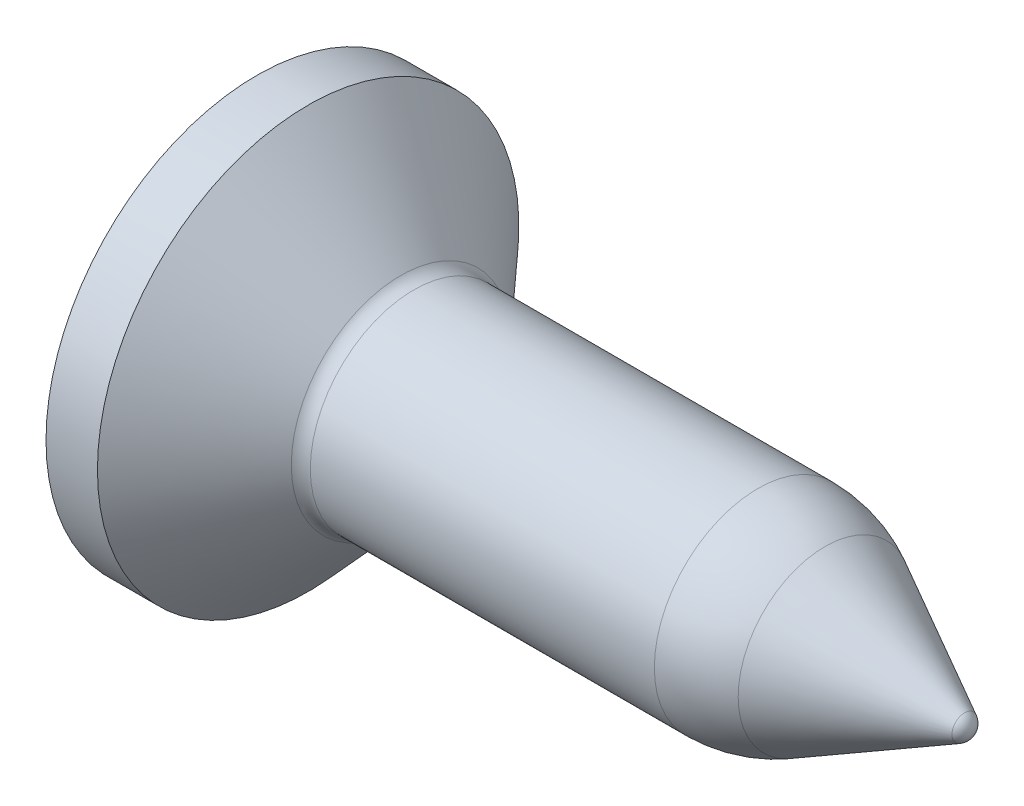
ISO-10303-21;
HEADER;
FILE_DESCRIPTION(('STEP AP214'),'2;1');
FILE_NAME('part.step','',(''),(''),'','','');
FILE_SCHEMA(('AUTOMOTIVE_DESIGN { 1 0 10303 214 1 1 1 1 }'));
ENDSEC;
DATA;
#1=APPLICATION_CONTEXT('core data for automotive mechanical design processes');
#2=APPLICATION_PROTOCOL_DEFINITION('international standard','automotive_design',2000,#1);
#3=PRODUCT_CONTEXT('',#1,'mechanical');
#4=PRODUCT('Part','Part','',(#3));
#5=PRODUCT_RELATED_PRODUCT_CATEGORY('part','',(#4));
#6=PRODUCT_DEFINITION_FORMATION('','',#4);
#7=PRODUCT_DEFINITION_CONTEXT('part definition',#1,'design');
#8=PRODUCT_DEFINITION('design','',#6,#7);
#9=PRODUCT_DEFINITION_SHAPE('','',#8);
#10=(LENGTH_UNIT() NAMED_UNIT(*) SI_UNIT(.MILLI.,.METRE.));
#11=(NAMED_UNIT(*) PLANE_ANGLE_UNIT() SI_UNIT($,.RADIAN.));
#12=(NAMED_UNIT(*) SI_UNIT($,.STERADIAN.) SOLID_ANGLE_UNIT());
#13=UNCERTAINTY_MEASURE_WITH_UNIT(LENGTH_MEASURE(1.E-05),#10,'distance_accuracy_value','');
#14=(GEOMETRIC_REPRESENTATION_CONTEXT(3) GLOBAL_UNCERTAINTY_ASSIGNED_CONTEXT((#13)) GLOBAL_UNIT_ASSIGNED_CONTEXT((#10,
#11,#12)) REPRESENTATION_CONTEXT('',''));
#15=CARTESIAN_POINT('',(0.,0.,0.));
#16=DIRECTION('',(0.,0.,1.));
#17=DIRECTION('',(1.,0.,0.));
#18=AXIS2_PLACEMENT_3D('',#15,#16,#17);
#19=CARTESIAN_POINT('',(9.81538931690745,0.,0.));
#20=DIRECTION('',(-1.,0.,0.));
#21=DIRECTION('',(0.,1.,0.));
#22=AXIS2_PLACEMENT_3D('',#19,#20,#21);
#23=SPHERICAL_SURFACE('',#22,0.200000000000001);
#24=CARTESIAN_POINT('',(9.90931550129047,0.,0.));
#25=DIRECTION('',(-1.,0.,0.));
#26=DIRECTION('',(0.,0.,1.));
#27=AXIS2_PLACEMENT_3D('',#24,#25,#26);
#28=CIRCLE('',#27,0.176572568331685);
#29=CARTESIAN_POINT('',(9.90931550129047,0.,0.176572568331685));
#30=VERTEX_POINT('',#29);
#31=EDGE_CURVE('E11',#30,#30,#28,.T.);
#32=ORIENTED_EDGE('',*,*,#31,.F.);
#33=EDGE_LOOP('',(#32));
#34=FACE_BOUND('',#33,.T.);
#35=ADVANCED_FACE('F33',(#34),#23,.T.);
#36=CARTESIAN_POINT('',(9.90931550129047,0.,0.));
#37=DIRECTION('',(-1.,0.,0.));
#38=DIRECTION('',(0.,0.,1.));
#39=AXIS2_PLACEMENT_3D('',#36,#37,#38);
#40=CONICAL_SURFACE('',#39,0.176572568331685,0.488872684597469);
#41=CARTESIAN_POINT('',(7.9558034363846,0.,0.));
#42=DIRECTION('',(-1.,0.,0.));
#43=DIRECTION('',(0.,0.,1.));
#44=AXIS2_PLACEMENT_3D('',#41,#42,#43);
#45=CIRCLE('',#44,1.21572568331684);
#46=CARTESIAN_POINT('',(7.9558034363846,0.,1.21572568331684));
#47=VERTEX_POINT('',#46);
#48=EDGE_CURVE('E40',#47,#47,#45,.T.);
#49=ORIENTED_EDGE('',*,*,#48,.F.);
#50=EDGE_LOOP('',(#49));
#51=FACE_BOUND('',#50,.T.);
#52=ORIENTED_EDGE('',*,*,#31,.T.);
#53=EDGE_LOOP('',(#52));
#54=FACE_BOUND('',#53,.T.);
#55=ADVANCED_FACE('F224',(#51,#54),#40,.T.);
#56=CARTESIAN_POINT('',(7.01654159255442,0.,0.));
#57=DIRECTION('',(-1.,0.,0.));
#58=DIRECTION('',(0.,0.,1.));
#59=AXIS2_PLACEMENT_3D('',#56,#57,#58);
#60=DEGENERATE_TOROIDAL_SURFACE('',#59,0.55,2.,.F.);
#61=CARTESIAN_POINT('',(7.01654159255442,0.,0.));
#62=DIRECTION('',(-1.,0.,0.));
#63=DIRECTION('',(0.,0.,1.));
#64=AXIS2_PLACEMENT_3D('',#61,#62,#63);
#65=CIRCLE('',#64,1.45);
#66=CARTESIAN_POINT('',(7.01654159255442,0.,1.45));
#67=VERTEX_POINT('',#66);
#68=EDGE_CURVE('E217',#67,#67,#65,.T.);
#69=ORIENTED_EDGE('',*,*,#68,.F.);
#70=EDGE_LOOP('',(#69));
#71=FACE_BOUND('',#70,.T.);
#72=ORIENTED_EDGE('',*,*,#48,.T.);
#73=EDGE_LOOP('',(#72));
#74=FACE_BOUND('',#73,.T.);
#75=ADVANCED_FACE('F222',(#71,#74),#60,.F.);
#76=CARTESIAN_POINT('',(-3.97468528266504,0.,0.));
#77=DIRECTION('',(-1.,0.,0.));
#78=DIRECTION('',(0.,0.,1.));
#79=AXIS2_PLACEMENT_3D('',#76,#77,#78);
#80=CYLINDRICAL_SURFACE('',#79,1.45);
#81=CARTESIAN_POINT('',(2.2,0.,0.));
#82=DIRECTION('',(-1.,0.,0.));
#83=DIRECTION('',(0.,0.,1.));
#84=AXIS2_PLACEMENT_3D('',#81,#82,#83);
#85=CIRCLE('',#84,1.45);
#86=CARTESIAN_POINT('',(2.2,0.,1.45));
#87=VERTEX_POINT('',#86);
#88=EDGE_CURVE('E214',#87,#87,#85,.T.);
#89=ORIENTED_EDGE('',*,*,#88,.F.);
#90=EDGE_LOOP('',(#89));
#91=FACE_BOUND('',#90,.T.);
#92=ORIENTED_EDGE('',*,*,#68,.T.);
#93=EDGE_LOOP('',(#92));
#94=FACE_BOUND('',#93,.T.);
#95=ADVANCED_FACE('F242',(#91,#94),#80,.T.);
#96=CARTESIAN_POINT('',(2.2,0.,0.));
#97=DIRECTION('',(-1.,0.,0.));
#98=DIRECTION('',(0.,0.,1.));
#99=AXIS2_PLACEMENT_3D('',#96,#97,#98);
#100=TOROIDAL_SURFACE('',#99,1.7,0.25);
#101=CARTESIAN_POINT('',(2.01538931690745,0.,0.));
#102=DIRECTION('',(-1.,0.,0.));
#103=DIRECTION('',(0.,0.,1.));
#104=AXIS2_PLACEMENT_3D('',#101,#102,#103);
#105=CIRCLE('',#104,1.53142095121842);
#106=CARTESIAN_POINT('',(2.01538931690745,0.,1.53142095121842));
#107=VERTEX_POINT('',#106);
#108=EDGE_CURVE('E211',#107,#107,#105,.T.);
#109=ORIENTED_EDGE('',*,*,#108,.F.);
#110=EDGE_LOOP('',(#109));
#111=FACE_BOUND('',#110,.T.);
#112=ORIENTED_EDGE('',*,*,#88,.T.);
#113=EDGE_LOOP('',(#112));
#114=FACE_BOUND('',#113,.T.);
#115=ADVANCED_FACE('F250',(#111,#114),#100,.F.);
#116=CARTESIAN_POINT('',(2.01538931690745,0.,0.));
#117=DIRECTION('',(-1.,0.,0.));
#118=DIRECTION('',(0.,0.,1.));
#119=AXIS2_PLACEMENT_3D('',#116,#117,#118);
#120=CONICAL_SURFACE('',#119,1.53142095121842,0.83075802591882);
#121=CARTESIAN_POINT('',(0.72,0.,0.));
#122=DIRECTION('',(-1.,0.,0.));
#123=DIRECTION('',(0.,0.,1.));
#124=AXIS2_PLACEMENT_3D('',#121,#122,#123);
#125=CIRCLE('',#124,2.95);
#126=CARTESIAN_POINT('',(0.72,0.,2.95));
#127=VERTEX_POINT('',#126);
#128=EDGE_CURVE('E208',#127,#127,#125,.T.);
#129=ORIENTED_EDGE('',*,*,#128,.F.);
#130=EDGE_LOOP('',(#129));
#131=FACE_BOUND('',#130,.T.);
#132=ORIENTED_EDGE('',*,*,#108,.T.);
#133=EDGE_LOOP('',(#132));
#134=FACE_BOUND('',#133,.T.);
#135=ADVANCED_FACE('F258',(#131,#134),#120,.T.);
#136=CARTESIAN_POINT('',(-3.97468528266504,0.,0.));
#137=DIRECTION('',(-1.,0.,0.));
#138=DIRECTION('',(0.,0.,1.));
#139=AXIS2_PLACEMENT_3D('',#136,#137,#138);
#140=CYLINDRICAL_SURFACE('',#139,2.95);
#141=CARTESIAN_POINT('',(0.,0.,0.));
#142=DIRECTION('',(-1.,0.,0.));
#143=DIRECTION('',(0.,0.,1.));
#144=AXIS2_PLACEMENT_3D('',#141,#142,#143);
#145=CIRCLE('',#144,2.95);
#146=CARTESIAN_POINT('',(0.,0.,2.95));
#147=VERTEX_POINT('',#146);
#148=EDGE_CURVE('E188',#147,#147,#145,.T.);
#149=ORIENTED_EDGE('',*,*,#148,.F.);
#150=EDGE_LOOP('',(#149));
#151=FACE_BOUND('',#150,.T.);
#152=ORIENTED_EDGE('',*,*,#128,.T.);
#153=EDGE_LOOP('',(#152));
#154=FACE_BOUND('',#153,.T.);
#155=ADVANCED_FACE('F266',(#151,#154),#140,.T.);
#156=CARTESIAN_POINT('',(0.,0.,0.));
#157=DIRECTION('',(1.,0.,0.));
#158=DIRECTION('',(0.,0.,-1.));
#159=AXIS2_PLACEMENT_3D('',#156,#157,#158);
#160=PLANE('',#159);
#161=DIRECTION('',(0.,0.,-1.));
#162=VECTOR('',#161,1.);
#163=CARTESIAN_POINT('',(0.,1.5,-0.25));
#164=LINE('',#163,#162);
#165=CARTESIAN_POINT('',(0.,1.5,0.25));
#166=VERTEX_POINT('',#165);
#167=CARTESIAN_POINT('',(0.,1.5,-0.25));
#168=VERTEX_POINT('',#167);
#169=EDGE_CURVE('E157',#166,#168,#164,.T.);
#170=ORIENTED_EDGE('',*,*,#169,.F.);
#171=DIRECTION('',(0.,0.984807753012209,-0.173648177666927));
#172=VECTOR('',#171,1.);
#173=CARTESIAN_POINT('',(0.,1.5,0.25));
#174=LINE('',#173,#172);
#175=CARTESIAN_POINT('',(0.,0.437370288618928,0.437370288618928));
#176=VERTEX_POINT('',#175);
#177=EDGE_CURVE('E47',#176,#166,#174,.T.);
#178=ORIENTED_EDGE('',*,*,#177,.F.);
#179=DIRECTION('',(0.,0.173648177666927,-0.984807753012209));
#180=VECTOR('',#179,1.);
#181=CARTESIAN_POINT('',(0.,0.437370288618928,0.437370288618928));
#182=LINE('',#181,#180);
#183=CARTESIAN_POINT('',(0.,0.25,1.5));
#184=VERTEX_POINT('',#183);
#185=EDGE_CURVE('E184',#184,#176,#182,.T.);
#186=ORIENTED_EDGE('',*,*,#185,.F.);
#187=DIRECTION('',(0.,1.,0.));
#188=VECTOR('',#187,1.);
#189=CARTESIAN_POINT('',(0.,0.25,1.5));
#190=LINE('',#189,#188);
#191=CARTESIAN_POINT('',(0.,-0.25,1.5));
#192=VERTEX_POINT('',#191);
#193=EDGE_CURVE('E182',#192,#184,#190,.T.);
#194=ORIENTED_EDGE('',*,*,#193,.F.);
#195=DIRECTION('',(0.,0.173648177666927,0.984807753012209));
#196=VECTOR('',#195,1.);
#197=CARTESIAN_POINT('',(0.,-0.437370288618928,0.437370288618928));
#198=LINE('',#197,#196);
#199=CARTESIAN_POINT('',(0.,-0.437370288618928,0.437370288618928));
#200=VERTEX_POINT('',#199);
#201=EDGE_CURVE('E131',#200,#192,#198,.T.);
#202=ORIENTED_EDGE('',*,*,#201,.F.);
#203=DIRECTION('',(0.,0.984807753012209,0.173648177666927));
#204=VECTOR('',#203,1.);
#205=CARTESIAN_POINT('',(0.,-1.5,0.25));
#206=LINE('',#205,#204);
#207=CARTESIAN_POINT('',(0.,-1.5,0.25));
#208=VERTEX_POINT('',#207);
#209=EDGE_CURVE('E178',#208,#200,#206,.T.);
#210=ORIENTED_EDGE('',*,*,#209,.F.);
#211=DIRECTION('',(0.,0.,1.));
#212=VECTOR('',#211,1.);
#213=CARTESIAN_POINT('',(0.,-1.5,-0.25));
#214=LINE('',#213,#212);
#215=CARTESIAN_POINT('',(0.,-1.5,-0.25));
#216=VERTEX_POINT('',#215);
#217=EDGE_CURVE('E175',#216,#208,#214,.T.);
#218=ORIENTED_EDGE('',*,*,#217,.F.);
#219=DIRECTION('',(0.,-0.984807753012209,0.173648177666927));
#220=VECTOR('',#219,1.);
#221=CARTESIAN_POINT('',(0.,-1.5,-0.25));
#222=LINE('',#221,#220);
#223=CARTESIAN_POINT('',(0.,-0.437370288618928,-0.437370288618928));
#224=VERTEX_POINT('',#223);
#225=EDGE_CURVE('E172',#224,#216,#222,.T.);
#226=ORIENTED_EDGE('',*,*,#225,.F.);
#227=DIRECTION('',(0.,-0.173648177666927,0.984807753012209));
#228=VECTOR('',#227,1.);
#229=CARTESIAN_POINT('',(0.,-0.437370288618928,-0.437370288618928));
#230=LINE('',#229,#228);
#231=CARTESIAN_POINT('',(0.,-0.25,-1.5));
#232=VERTEX_POINT('',#231);
#233=EDGE_CURVE('E169',#232,#224,#230,.T.);
#234=ORIENTED_EDGE('',*,*,#233,.F.);
#235=DIRECTION('',(0.,-1.,0.));
#236=VECTOR('',#235,1.);
#237=CARTESIAN_POINT('',(0.,0.25,-1.5));
#238=LINE('',#237,#236);
#239=CARTESIAN_POINT('',(0.,0.25,-1.5));
#240=VERTEX_POINT('',#239);
#241=EDGE_CURVE('E166',#240,#232,#238,.T.);
#242=ORIENTED_EDGE('',*,*,#241,.F.);
#243=DIRECTION('',(0.,-0.173648177666927,-0.984807753012209));
#244=VECTOR('',#243,1.);
#245=CARTESIAN_POINT('',(0.,0.437370288618928,-0.437370288618928));
#246=LINE('',#245,#244);
#247=CARTESIAN_POINT('',(0.,0.437370288618928,-0.437370288618928));
#248=VERTEX_POINT('',#247);
#249=EDGE_CURVE('E163',#248,#240,#246,.T.);
#250=ORIENTED_EDGE('',*,*,#249,.F.);
#251=DIRECTION('',(0.,-0.984807753012209,-0.173648177666927));
#252=VECTOR('',#251,1.);
#253=CARTESIAN_POINT('',(0.,1.5,-0.25));
#254=LINE('',#253,#252);
#255=EDGE_CURVE('E160',#168,#248,#254,.T.);
#256=ORIENTED_EDGE('',*,*,#255,.F.);
#257=EDGE_LOOP('',(#170,#178,#186,#194,#202,#210,#218,#226,#234,#242,#250,#256));
#258=FACE_BOUND('',#257,.T.);
#259=ORIENTED_EDGE('',*,*,#148,.T.);
#260=EDGE_LOOP('',(#259));
#261=FACE_BOUND('',#260,.T.);
#262=ADVANCED_FACE('F274',(#258,#261),#160,.F.);
#263=CARTESIAN_POINT('',(0.5,1.5,0.25));
#264=DIRECTION('',(0.,0.173648177666927,0.984807753012209));
#265=DIRECTION('',(0.,-0.984807753012209,0.173648177666927));
#266=AXIS2_PLACEMENT_3D('',#263,#264,#265);
#267=PLANE('',#266);
#268=ORIENTED_EDGE('',*,*,#177,.T.);
#269=DIRECTION('',(-1.,0.,0.));
#270=VECTOR('',#269,1.);
#271=CARTESIAN_POINT('',(0.5,1.5,0.25));
#272=LINE('',#271,#270);
#273=CARTESIAN_POINT('',(0.5,1.5,0.25));
#274=VERTEX_POINT('',#273);
#275=EDGE_CURVE('E95',#274,#166,#272,.T.);
#276=ORIENTED_EDGE('',*,*,#275,.F.);
#277=DIRECTION('',(0.,0.984807753012209,-0.173648177666927));
#278=VECTOR('',#277,1.);
#279=CARTESIAN_POINT('',(0.5,1.5,0.25));
#280=LINE('',#279,#278);
#281=CARTESIAN_POINT('',(0.5,0.437370288618928,0.437370288618928));
#282=VERTEX_POINT('',#281);
#283=EDGE_CURVE('E186',#282,#274,#280,.T.);
#284=ORIENTED_EDGE('',*,*,#283,.F.);
#285=DIRECTION('',(-1.,0.,0.));
#286=VECTOR('',#285,1.);
#287=CARTESIAN_POINT('',(0.5,0.437370288618928,0.437370288618928));
#288=LINE('',#287,#286);
#289=EDGE_CURVE('E55',#282,#176,#288,.T.);
#290=ORIENTED_EDGE('',*,*,#289,.T.);
#291=EDGE_LOOP('',(#268,#276,#284,#290));
#292=FACE_BOUND('',#291,.T.);
#293=ADVANCED_FACE('F282',(#292),#267,.F.);
#294=CARTESIAN_POINT('',(0.5,0.437370288618928,0.437370288618928));
#295=DIRECTION('',(0.,0.984807753012209,0.173648177666927));
#296=DIRECTION('',(0.,-0.173648177666927,0.984807753012209));
#297=AXIS2_PLACEMENT_3D('',#294,#295,#296);
#298=PLANE('',#297);
#299=ORIENTED_EDGE('',*,*,#185,.T.);
#300=ORIENTED_EDGE('',*,*,#289,.F.);
#301=DIRECTION('',(0.,0.173648177666927,-0.984807753012209));
#302=VECTOR('',#301,1.);
#303=CARTESIAN_POINT('',(0.5,0.437370288618928,0.437370288618928));
#304=LINE('',#303,#302);
#305=CARTESIAN_POINT('',(0.5,0.25,1.5));
#306=VERTEX_POINT('',#305);
#307=EDGE_CURVE('E143',#306,#282,#304,.T.);
#308=ORIENTED_EDGE('',*,*,#307,.F.);
#309=DIRECTION('',(-1.,0.,0.));
#310=VECTOR('',#309,1.);
#311=CARTESIAN_POINT('',(0.5,0.25,1.5));
#312=LINE('',#311,#310);
#313=EDGE_CURVE('E135',#306,#184,#312,.T.);
#314=ORIENTED_EDGE('',*,*,#313,.T.);
#315=EDGE_LOOP('',(#299,#300,#308,#314));
#316=FACE_BOUND('',#315,.T.);
#317=ADVANCED_FACE('F290',(#316),#298,.F.);
#318=CARTESIAN_POINT('',(0.5,0.25,1.5));
#319=DIRECTION('',(0.,0.,1.));
#320=DIRECTION('',(1.,0.,0.));
#321=AXIS2_PLACEMENT_3D('',#318,#319,#320);
#322=PLANE('',#321);
#323=ORIENTED_EDGE('',*,*,#193,.T.);
#324=ORIENTED_EDGE('',*,*,#313,.F.);
#325=DIRECTION('',(0.,1.,0.));
#326=VECTOR('',#325,1.);
#327=CARTESIAN_POINT('',(0.5,0.25,1.5));
#328=LINE('',#327,#326);
#329=CARTESIAN_POINT('',(0.5,-0.25,1.5));
#330=VERTEX_POINT('',#329);
#331=EDGE_CURVE('E139',#330,#306,#328,.T.);
#332=ORIENTED_EDGE('',*,*,#331,.F.);
#333=DIRECTION('',(-1.,0.,0.));
#334=VECTOR('',#333,1.);
#335=CARTESIAN_POINT('',(0.5,-0.25,1.5));
#336=LINE('',#335,#334);
#337=EDGE_CURVE('E124',#330,#192,#336,.T.);
#338=ORIENTED_EDGE('',*,*,#337,.T.);
#339=EDGE_LOOP('',(#323,#324,#332,#338));
#340=FACE_BOUND('',#339,.T.);
#341=ADVANCED_FACE('F140',(#340),#322,.F.);
#342=CARTESIAN_POINT('',(0.5,-0.437370288618928,0.437370288618928));
#343=DIRECTION('',(0.,-0.984807753012209,0.173648177666927));
#344=DIRECTION('',(0.,-0.173648177666927,-0.984807753012209));
#345=AXIS2_PLACEMENT_3D('',#342,#343,#344);
#346=PLANE('',#345);
#347=ORIENTED_EDGE('',*,*,#201,.T.);
#348=ORIENTED_EDGE('',*,*,#337,.F.);
#349=DIRECTION('',(0.,0.173648177666927,0.984807753012209));
#350=VECTOR('',#349,1.);
#351=CARTESIAN_POINT('',(0.5,-0.437370288618928,0.437370288618928));
#352=LINE('',#351,#350);
#353=CARTESIAN_POINT('',(0.5,-0.437370288618928,0.437370288618928));
#354=VERTEX_POINT('',#353);
#355=EDGE_CURVE('E128',#354,#330,#352,.T.);
#356=ORIENTED_EDGE('',*,*,#355,.F.);
#357=DIRECTION('',(-1.,0.,0.));
#358=VECTOR('',#357,1.);
#359=CARTESIAN_POINT('',(0.5,-0.437370288618928,0.437370288618928));
#360=LINE('',#359,#358);
#361=EDGE_CURVE('E136',#354,#200,#360,.T.);
#362=ORIENTED_EDGE('',*,*,#361,.T.);
#363=EDGE_LOOP('',(#347,#348,#356,#362));
#364=FACE_BOUND('',#363,.T.);
#365=ADVANCED_FACE('F126',(#364),#346,.F.);
#366=CARTESIAN_POINT('',(0.5,-1.5,0.25));
#367=DIRECTION('',(0.,-0.173648177666927,0.984807753012209));
#368=DIRECTION('',(0.,-0.984807753012209,-0.173648177666927));
#369=AXIS2_PLACEMENT_3D('',#366,#367,#368);
#370=PLANE('',#369);
#371=ORIENTED_EDGE('',*,*,#209,.T.);
#372=ORIENTED_EDGE('',*,*,#361,.F.);
#373=DIRECTION('',(0.,0.984807753012209,0.173648177666927));
#374=VECTOR('',#373,1.);
#375=CARTESIAN_POINT('',(0.5,-1.5,0.25));
#376=LINE('',#375,#374);
#377=CARTESIAN_POINT('',(0.5,-1.5,0.25));
#378=VERTEX_POINT('',#377);
#379=EDGE_CURVE('E149',#378,#354,#376,.T.);
#380=ORIENTED_EDGE('',*,*,#379,.F.);
#381=DIRECTION('',(-1.,0.,0.));
#382=VECTOR('',#381,1.);
#383=CARTESIAN_POINT('',(0.5,-1.5,0.25));
#384=LINE('',#383,#382);
#385=EDGE_CURVE('E191',#378,#208,#384,.T.);
#386=ORIENTED_EDGE('',*,*,#385,.T.);
#387=EDGE_LOOP('',(#371,#372,#380,#386));
#388=FACE_BOUND('',#387,.T.);
#389=ADVANCED_FACE('F309',(#388),#370,.F.);
#390=CARTESIAN_POINT('',(0.5,-1.5,-0.25));
#391=DIRECTION('',(0.,-1.,0.));
#392=DIRECTION('',(0.,0.,-1.));
#393=AXIS2_PLACEMENT_3D('',#390,#391,#392);
#394=PLANE('',#393);
#395=ORIENTED_EDGE('',*,*,#217,.T.);
#396=ORIENTED_EDGE('',*,*,#385,.F.);
#397=DIRECTION('',(0.,0.,1.));
#398=VECTOR('',#397,1.);
#399=CARTESIAN_POINT('',(0.5,-1.5,-0.25));
#400=LINE('',#399,#398);
#401=CARTESIAN_POINT('',(0.5,-1.5,-0.25));
#402=VERTEX_POINT('',#401);
#403=EDGE_CURVE('E151',#402,#378,#400,.T.);
#404=ORIENTED_EDGE('',*,*,#403,.F.);
#405=DIRECTION('',(-1.,0.,0.));
#406=VECTOR('',#405,1.);
#407=CARTESIAN_POINT('',(0.5,-1.5,-0.25));
#408=LINE('',#407,#406);
#409=EDGE_CURVE('E193',#402,#216,#408,.T.);
#410=ORIENTED_EDGE('',*,*,#409,.T.);
#411=EDGE_LOOP('',(#395,#396,#404,#410));
#412=FACE_BOUND('',#411,.T.);
#413=ADVANCED_FACE('F316',(#412),#394,.F.);
#414=CARTESIAN_POINT('',(0.5,-1.5,-0.25));
#415=DIRECTION('',(0.,-0.173648177666927,-0.984807753012209));
#416=DIRECTION('',(0.,0.984807753012209,-0.173648177666927));
#417=AXIS2_PLACEMENT_3D('',#414,#415,#416);
#418=PLANE('',#417);
#419=ORIENTED_EDGE('',*,*,#225,.T.);
#420=ORIENTED_EDGE('',*,*,#409,.F.);
#421=DIRECTION('',(0.,-0.984807753012209,0.173648177666927));
#422=VECTOR('',#421,1.);
#423=CARTESIAN_POINT('',(0.5,-1.5,-0.25));
#424=LINE('',#423,#422);
#425=CARTESIAN_POINT('',(0.5,-0.437370288618928,-0.437370288618928));
#426=VERTEX_POINT('',#425);
#427=EDGE_CURVE('E447',#426,#402,#424,.T.);
#428=ORIENTED_EDGE('',*,*,#427,.F.);
#429=DIRECTION('',(-1.,0.,0.));
#430=VECTOR('',#429,1.);
#431=CARTESIAN_POINT('',(0.5,-0.437370288618928,-0.437370288618928));
#432=LINE('',#431,#430);
#433=EDGE_CURVE('E195',#426,#224,#432,.T.);
#434=ORIENTED_EDGE('',*,*,#433,.T.);
#435=EDGE_LOOP('',(#419,#420,#428,#434));
#436=FACE_BOUND('',#435,.T.);
#437=ADVANCED_FACE('F324',(#436),#418,.F.);
#438=CARTESIAN_POINT('',(0.5,-0.437370288618928,-0.437370288618928));
#439=DIRECTION('',(0.,-0.984807753012209,-0.173648177666927));
#440=DIRECTION('',(0.,0.173648177666927,-0.984807753012209));
#441=AXIS2_PLACEMENT_3D('',#438,#439,#440);
#442=PLANE('',#441);
#443=ORIENTED_EDGE('',*,*,#233,.T.);
#444=ORIENTED_EDGE('',*,*,#433,.F.);
#445=DIRECTION('',(0.,-0.173648177666927,0.984807753012209));
#446=VECTOR('',#445,1.);
#447=CARTESIAN_POINT('',(0.5,-0.437370288618928,-0.437370288618928));
#448=LINE('',#447,#446);
#449=CARTESIAN_POINT('',(0.5,-0.25,-1.5));
#450=VERTEX_POINT('',#449);
#451=EDGE_CURVE('E444',#450,#426,#448,.T.);
#452=ORIENTED_EDGE('',*,*,#451,.F.);
#453=DIRECTION('',(-1.,0.,0.));
#454=VECTOR('',#453,1.);
#455=CARTESIAN_POINT('',(0.5,-0.25,-1.5));
#456=LINE('',#455,#454);
#457=EDGE_CURVE('E197',#450,#232,#456,.T.);
#458=ORIENTED_EDGE('',*,*,#457,.T.);
#459=EDGE_LOOP('',(#443,#444,#452,#458));
#460=FACE_BOUND('',#459,.T.);
#461=ADVANCED_FACE('F332',(#460),#442,.F.);
#462=CARTESIAN_POINT('',(0.5,0.25,-1.5));
#463=DIRECTION('',(0.,0.,-1.));
#464=DIRECTION('',(-1.,0.,0.));
#465=AXIS2_PLACEMENT_3D('',#462,#463,#464);
#466=PLANE('',#465);
#467=ORIENTED_EDGE('',*,*,#241,.T.);
#468=ORIENTED_EDGE('',*,*,#457,.F.);
#469=DIRECTION('',(0.,-1.,0.));
#470=VECTOR('',#469,1.);
#471=CARTESIAN_POINT('',(0.5,0.25,-1.5));
#472=LINE('',#471,#470);
#473=CARTESIAN_POINT('',(0.5,0.25,-1.5));
#474=VERTEX_POINT('',#473);
#475=EDGE_CURVE('E441',#474,#450,#472,.T.);
#476=ORIENTED_EDGE('',*,*,#475,.F.);
#477=DIRECTION('',(-1.,0.,0.));
#478=VECTOR('',#477,1.);
#479=CARTESIAN_POINT('',(0.5,0.25,-1.5));
#480=LINE('',#479,#478);
#481=EDGE_CURVE('E199',#474,#240,#480,.T.);
#482=ORIENTED_EDGE('',*,*,#481,.T.);
#483=EDGE_LOOP('',(#467,#468,#476,#482));
#484=FACE_BOUND('',#483,.T.);
#485=ADVANCED_FACE('F340',(#484),#466,.F.);
#486=CARTESIAN_POINT('',(0.5,0.437370288618928,-0.437370288618928));
#487=DIRECTION('',(0.,0.984807753012209,-0.173648177666927));
#488=DIRECTION('',(0.,0.173648177666927,0.984807753012209));
#489=AXIS2_PLACEMENT_3D('',#486,#487,#488);
#490=PLANE('',#489);
#491=ORIENTED_EDGE('',*,*,#249,.T.);
#492=ORIENTED_EDGE('',*,*,#481,.F.);
#493=DIRECTION('',(0.,-0.173648177666927,-0.984807753012209));
#494=VECTOR('',#493,1.);
#495=CARTESIAN_POINT('',(0.5,0.437370288618928,-0.437370288618928));
#496=LINE('',#495,#494);
#497=CARTESIAN_POINT('',(0.5,0.437370288618928,-0.437370288618928));
#498=VERTEX_POINT('',#497);
#499=EDGE_CURVE('E434',#498,#474,#496,.T.);
#500=ORIENTED_EDGE('',*,*,#499,.F.);
#501=DIRECTION('',(-1.,0.,0.));
#502=VECTOR('',#501,1.);
#503=CARTESIAN_POINT('',(0.5,0.437370288618928,-0.437370288618928));
#504=LINE('',#503,#502);
#505=EDGE_CURVE('E201',#498,#248,#504,.T.);
#506=ORIENTED_EDGE('',*,*,#505,.T.);
#507=EDGE_LOOP('',(#491,#492,#500,#506));
#508=FACE_BOUND('',#507,.T.);
#509=ADVANCED_FACE('F348',(#508),#490,.F.);
#510=CARTESIAN_POINT('',(0.5,1.5,-0.25));
#511=DIRECTION('',(0.,0.173648177666927,-0.984807753012209));
#512=DIRECTION('',(0.,0.984807753012209,0.173648177666927));
#513=AXIS2_PLACEMENT_3D('',#510,#511,#512);
#514=PLANE('',#513);
#515=ORIENTED_EDGE('',*,*,#255,.T.);
#516=ORIENTED_EDGE('',*,*,#505,.F.);
#517=DIRECTION('',(0.,-0.984807753012209,-0.173648177666927));
#518=VECTOR('',#517,1.);
#519=CARTESIAN_POINT('',(0.5,1.5,-0.25));
#520=LINE('',#519,#518);
#521=CARTESIAN_POINT('',(0.5,1.5,-0.25));
#522=VERTEX_POINT('',#521);
#523=EDGE_CURVE('E431',#522,#498,#520,.T.);
#524=ORIENTED_EDGE('',*,*,#523,.F.);
#525=DIRECTION('',(-1.,0.,0.));
#526=VECTOR('',#525,1.);
#527=CARTESIAN_POINT('',(0.5,1.5,-0.25));
#528=LINE('',#527,#526);
#529=EDGE_CURVE('E203',#522,#168,#528,.T.);
#530=ORIENTED_EDGE('',*,*,#529,.T.);
#531=EDGE_LOOP('',(#515,#516,#524,#530));
#532=FACE_BOUND('',#531,.T.);
#533=ADVANCED_FACE('F356',(#532),#514,.F.);
#534=CARTESIAN_POINT('',(0.5,1.5,-0.25));
#535=DIRECTION('',(0.,1.,0.));
#536=DIRECTION('',(0.,0.,1.));
#537=AXIS2_PLACEMENT_3D('',#534,#535,#536);
#538=PLANE('',#537);
#539=ORIENTED_EDGE('',*,*,#169,.T.);
#540=ORIENTED_EDGE('',*,*,#529,.F.);
#541=DIRECTION('',(0.,0.,-1.));
#542=VECTOR('',#541,1.);
#543=CARTESIAN_POINT('',(0.5,1.5,-0.25));
#544=LINE('',#543,#542);
#545=EDGE_CURVE('E435',#274,#522,#544,.T.);
#546=ORIENTED_EDGE('',*,*,#545,.F.);
#547=ORIENTED_EDGE('',*,*,#275,.T.);
#548=EDGE_LOOP('',(#539,#540,#546,#547));
#549=FACE_BOUND('',#548,.T.);
#550=ADVANCED_FACE('F364',(#549),#538,.F.);
#551=CARTESIAN_POINT('',(0.5,0.,0.));
#552=DIRECTION('',(-1.,0.,0.));
#553=DIRECTION('',(0.,0.,1.));
#554=AXIS2_PLACEMENT_3D('',#551,#552,#553);
#555=PLANE('',#554);
#556=ORIENTED_EDGE('',*,*,#283,.T.);
#557=ORIENTED_EDGE('',*,*,#545,.T.);
#558=ORIENTED_EDGE('',*,*,#523,.T.);
#559=ORIENTED_EDGE('',*,*,#499,.T.);
#560=ORIENTED_EDGE('',*,*,#475,.T.);
#561=ORIENTED_EDGE('',*,*,#451,.T.);
#562=ORIENTED_EDGE('',*,*,#427,.T.);
#563=ORIENTED_EDGE('',*,*,#403,.T.);
#564=ORIENTED_EDGE('',*,*,#379,.T.);
#565=ORIENTED_EDGE('',*,*,#355,.T.);
#566=ORIENTED_EDGE('',*,*,#331,.T.);
#567=ORIENTED_EDGE('',*,*,#307,.T.);
#568=EDGE_LOOP('',(#556,#557,#558,#559,#560,#561,#562,#563,#564,#565,#566,#567));
#569=FACE_BOUND('',#568,.T.);
#570=ADVANCED_FACE('F146',(#569),#555,.T.);
#571=CLOSED_SHELL('',(#35,#55,#75,#95,#115,#135,#155,#262,#293,#317,#341,#365,#389,#413,#437,
#461,#485,#509,#533,#550,#570));
#572=MANIFOLD_SOLID_BREP('B2',#571);
#573=ADVANCED_BREP_SHAPE_REPRESENTATION('',(#18,#572),#14);
#574=SHAPE_DEFINITION_REPRESENTATION(#9,#573);
ENDSEC;
END-ISO-10303-21;
